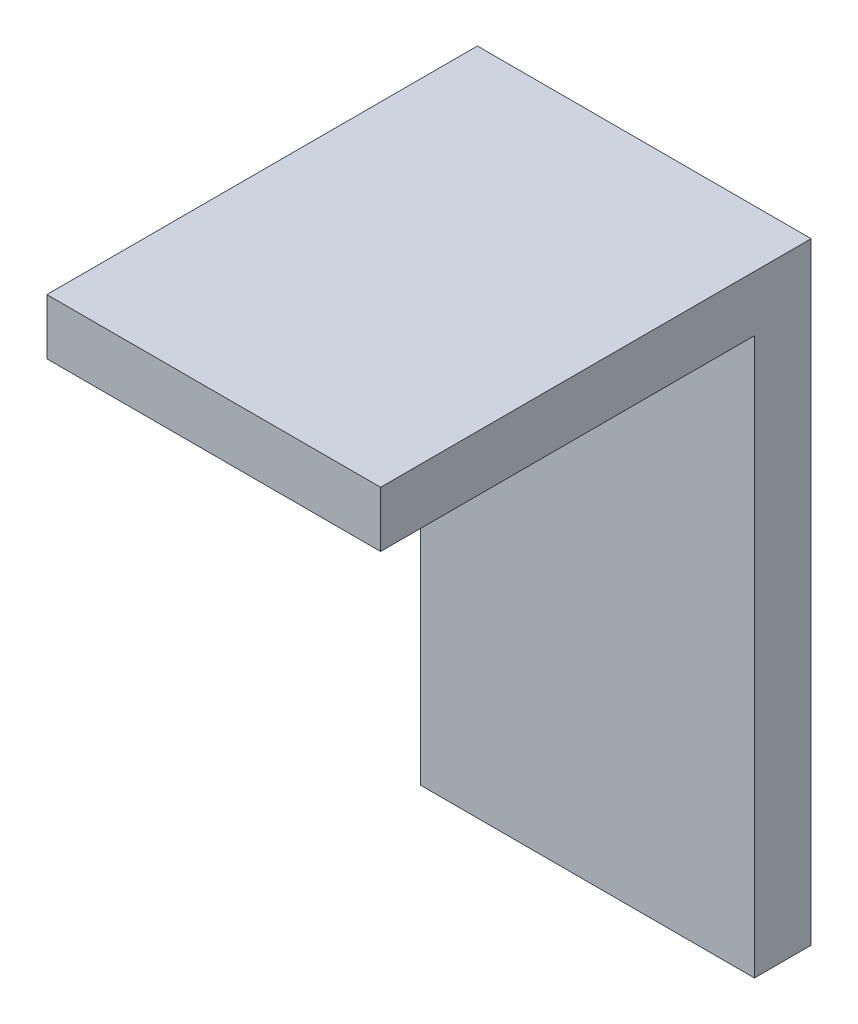
ISO-10303-21;
HEADER;
FILE_DESCRIPTION(('STEP AP214'),'2;1');
FILE_NAME('part.step','',(''),(''),'','','');
FILE_SCHEMA(('AUTOMOTIVE_DESIGN { 1 0 10303 214 1 1 1 1 }'));
ENDSEC;
DATA;
#1=APPLICATION_CONTEXT('core data for automotive mechanical design processes');
#2=APPLICATION_PROTOCOL_DEFINITION('international standard','automotive_design',2000,#1);
#3=PRODUCT_CONTEXT('',#1,'mechanical');
#4=PRODUCT('Part','Part','',(#3));
#5=PRODUCT_RELATED_PRODUCT_CATEGORY('part','',(#4));
#6=PRODUCT_DEFINITION_FORMATION('','',#4);
#7=PRODUCT_DEFINITION_CONTEXT('part definition',#1,'design');
#8=PRODUCT_DEFINITION('design','',#6,#7);
#9=PRODUCT_DEFINITION_SHAPE('','',#8);
#10=(LENGTH_UNIT() NAMED_UNIT(*) SI_UNIT(.MILLI.,.METRE.));
#11=(NAMED_UNIT(*) PLANE_ANGLE_UNIT() SI_UNIT($,.RADIAN.));
#12=(NAMED_UNIT(*) SI_UNIT($,.STERADIAN.) SOLID_ANGLE_UNIT());
#13=UNCERTAINTY_MEASURE_WITH_UNIT(LENGTH_MEASURE(1.E-05),#10,'distance_accuracy_value','');
#14=(GEOMETRIC_REPRESENTATION_CONTEXT(3) GLOBAL_UNCERTAINTY_ASSIGNED_CONTEXT((#13)) GLOBAL_UNIT_ASSIGNED_CONTEXT((#10,
#11,#12)) REPRESENTATION_CONTEXT('',''));
#15=CARTESIAN_POINT('',(0.,0.,0.));
#16=DIRECTION('',(0.,0.,1.));
#17=DIRECTION('',(1.,0.,0.));
#18=AXIS2_PLACEMENT_3D('',#15,#16,#17);
#19=CARTESIAN_POINT('',(2.6,4.55,0.));
#20=DIRECTION('',(-1.,0.,0.));
#21=DIRECTION('',(0.,0.,1.));
#22=AXIS2_PLACEMENT_3D('',#19,#20,#21);
#23=PLANE('',#22);
#24=DIRECTION('',(0.,1.,0.));
#25=VECTOR('',#24,1.);
#26=CARTESIAN_POINT('',(2.6,4.,0.));
#27=LINE('',#26,#25);
#28=CARTESIAN_POINT('',(2.6,4.,0.));
#29=VERTEX_POINT('',#28);
#30=CARTESIAN_POINT('',(2.6,4.55,0.));
#31=VERTEX_POINT('',#30);
#32=EDGE_CURVE('E11',#29,#31,#27,.T.);
#33=ORIENTED_EDGE('',*,*,#32,.F.);
#34=DIRECTION('',(0.,0.,-1.));
#35=VECTOR('',#34,1.);
#36=CARTESIAN_POINT('',(2.6,4.,0.051));
#37=LINE('',#36,#35);
#38=CARTESIAN_POINT('',(2.6,4.,0.051));
#39=VERTEX_POINT('',#38);
#40=EDGE_CURVE('E24',#39,#29,#37,.T.);
#41=ORIENTED_EDGE('',*,*,#40,.F.);
#42=DIRECTION('',(0.,-1.,0.));
#43=VECTOR('',#42,1.);
#44=CARTESIAN_POINT('',(2.6,4.5,0.051));
#45=LINE('',#44,#43);
#46=CARTESIAN_POINT('',(2.6,4.5,0.051));
#47=VERTEX_POINT('',#46);
#48=EDGE_CURVE('E87',#47,#39,#45,.T.);
#49=ORIENTED_EDGE('',*,*,#48,.F.);
#50=DIRECTION('',(0.,0.,-1.));
#51=VECTOR('',#50,1.);
#52=CARTESIAN_POINT('',(2.6,4.5,0.387));
#53=LINE('',#52,#51);
#54=CARTESIAN_POINT('',(2.6,4.5,0.387));
#55=VERTEX_POINT('',#54);
#56=EDGE_CURVE('E114',#55,#47,#53,.T.);
#57=ORIENTED_EDGE('',*,*,#56,.F.);
#58=DIRECTION('',(0.,-1.,0.));
#59=VECTOR('',#58,1.);
#60=CARTESIAN_POINT('',(2.6,4.55,0.387));
#61=LINE('',#60,#59);
#62=CARTESIAN_POINT('',(2.6,4.55,0.387));
#63=VERTEX_POINT('',#62);
#64=EDGE_CURVE('E111',#63,#55,#61,.T.);
#65=ORIENTED_EDGE('',*,*,#64,.F.);
#66=DIRECTION('',(0.,0.,1.));
#67=VECTOR('',#66,1.);
#68=CARTESIAN_POINT('',(2.6,4.55,0.));
#69=LINE('',#68,#67);
#70=EDGE_CURVE('E108',#31,#63,#69,.T.);
#71=ORIENTED_EDGE('',*,*,#70,.F.);
#72=EDGE_LOOP('',(#33,#41,#49,#57,#65,#71));
#73=FACE_BOUND('',#72,.T.);
#74=ADVANCED_FACE('F17',(#73),#23,.T.);
#75=CARTESIAN_POINT('',(2.9,4.,0.));
#76=DIRECTION('',(1.,0.,0.));
#77=DIRECTION('',(0.,0.,1.));
#78=AXIS2_PLACEMENT_3D('',#75,#76,#77);
#79=PLANE('',#78);
#80=DIRECTION('',(0.,-1.,0.));
#81=VECTOR('',#80,1.);
#82=CARTESIAN_POINT('',(2.9,4.55,0.));
#83=LINE('',#82,#81);
#84=CARTESIAN_POINT('',(2.9,4.55,0.));
#85=VERTEX_POINT('',#84);
#86=CARTESIAN_POINT('',(2.9,4.,0.));
#87=VERTEX_POINT('',#86);
#88=EDGE_CURVE('E106',#85,#87,#83,.T.);
#89=ORIENTED_EDGE('',*,*,#88,.F.);
#90=DIRECTION('',(0.,0.,-1.));
#91=VECTOR('',#90,1.);
#92=CARTESIAN_POINT('',(2.9,4.55,0.387));
#93=LINE('',#92,#91);
#94=CARTESIAN_POINT('',(2.9,4.55,0.387));
#95=VERTEX_POINT('',#94);
#96=EDGE_CURVE('E103',#95,#85,#93,.T.);
#97=ORIENTED_EDGE('',*,*,#96,.F.);
#98=DIRECTION('',(0.,1.,0.));
#99=VECTOR('',#98,1.);
#100=CARTESIAN_POINT('',(2.9,4.5,0.387));
#101=LINE('',#100,#99);
#102=CARTESIAN_POINT('',(2.9,4.5,0.387));
#103=VERTEX_POINT('',#102);
#104=EDGE_CURVE('E100',#103,#95,#101,.T.);
#105=ORIENTED_EDGE('',*,*,#104,.F.);
#106=DIRECTION('',(0.,0.,1.));
#107=VECTOR('',#106,1.);
#108=CARTESIAN_POINT('',(2.9,4.5,0.051));
#109=LINE('',#108,#107);
#110=CARTESIAN_POINT('',(2.9,4.5,0.051));
#111=VERTEX_POINT('',#110);
#112=EDGE_CURVE('E72',#111,#103,#109,.T.);
#113=ORIENTED_EDGE('',*,*,#112,.F.);
#114=DIRECTION('',(0.,1.,0.));
#115=VECTOR('',#114,1.);
#116=CARTESIAN_POINT('',(2.9,4.,0.051));
#117=LINE('',#116,#115);
#118=CARTESIAN_POINT('',(2.9,4.,0.051));
#119=VERTEX_POINT('',#118);
#120=EDGE_CURVE('E66',#119,#111,#117,.T.);
#121=ORIENTED_EDGE('',*,*,#120,.F.);
#122=DIRECTION('',(0.,0.,1.));
#123=VECTOR('',#122,1.);
#124=CARTESIAN_POINT('',(2.9,4.,0.));
#125=LINE('',#124,#123);
#126=EDGE_CURVE('E69',#87,#119,#125,.T.);
#127=ORIENTED_EDGE('',*,*,#126,.F.);
#128=EDGE_LOOP('',(#89,#97,#105,#113,#121,#127));
#129=FACE_BOUND('',#128,.T.);
#130=ADVANCED_FACE('F68',(#129),#79,.T.);
#131=CARTESIAN_POINT('',(2.6,4.55,0.387));
#132=DIRECTION('',(0.,0.,1.));
#133=DIRECTION('',(0.,1.,0.));
#134=AXIS2_PLACEMENT_3D('',#131,#132,#133);
#135=PLANE('',#134);
#136=ORIENTED_EDGE('',*,*,#64,.T.);
#137=DIRECTION('',(-1.,0.,0.));
#138=VECTOR('',#137,1.);
#139=CARTESIAN_POINT('',(2.9,4.5,0.387));
#140=LINE('',#139,#138);
#141=EDGE_CURVE('E83',#103,#55,#140,.T.);
#142=ORIENTED_EDGE('',*,*,#141,.F.);
#143=ORIENTED_EDGE('',*,*,#104,.T.);
#144=DIRECTION('',(1.,0.,0.));
#145=VECTOR('',#144,1.);
#146=CARTESIAN_POINT('',(2.6,4.55,0.387));
#147=LINE('',#146,#145);
#148=EDGE_CURVE('E88',#63,#95,#147,.T.);
#149=ORIENTED_EDGE('',*,*,#148,.F.);
#150=EDGE_LOOP('',(#136,#142,#143,#149));
#151=FACE_BOUND('',#150,.T.);
#152=ADVANCED_FACE('F125',(#151),#135,.T.);
#153=CARTESIAN_POINT('',(2.6,4.5,0.051));
#154=DIRECTION('',(0.,0.,1.));
#155=DIRECTION('',(0.,1.,0.));
#156=AXIS2_PLACEMENT_3D('',#153,#154,#155);
#157=PLANE('',#156);
#158=ORIENTED_EDGE('',*,*,#48,.T.);
#159=DIRECTION('',(-1.,0.,0.));
#160=VECTOR('',#159,1.);
#161=CARTESIAN_POINT('',(2.9,4.,0.051));
#162=LINE('',#161,#160);
#163=EDGE_CURVE('E81',#119,#39,#162,.T.);
#164=ORIENTED_EDGE('',*,*,#163,.F.);
#165=ORIENTED_EDGE('',*,*,#120,.T.);
#166=DIRECTION('',(1.,0.,0.));
#167=VECTOR('',#166,1.);
#168=CARTESIAN_POINT('',(2.6,4.5,0.051));
#169=LINE('',#168,#167);
#170=EDGE_CURVE('E89',#47,#111,#169,.T.);
#171=ORIENTED_EDGE('',*,*,#170,.F.);
#172=EDGE_LOOP('',(#158,#164,#165,#171));
#173=FACE_BOUND('',#172,.T.);
#174=ADVANCED_FACE('F86',(#173),#157,.T.);
#175=CARTESIAN_POINT('',(2.9,4.55,0.));
#176=DIRECTION('',(0.,1.,0.));
#177=DIRECTION('',(0.,0.,1.));
#178=AXIS2_PLACEMENT_3D('',#175,#176,#177);
#179=PLANE('',#178);
#180=DIRECTION('',(1.,0.,0.));
#181=VECTOR('',#180,1.);
#182=CARTESIAN_POINT('',(2.6,4.55,0.));
#183=LINE('',#182,#181);
#184=EDGE_CURVE('E93',#31,#85,#183,.T.);
#185=ORIENTED_EDGE('',*,*,#184,.F.);
#186=ORIENTED_EDGE('',*,*,#70,.T.);
#187=ORIENTED_EDGE('',*,*,#148,.T.);
#188=ORIENTED_EDGE('',*,*,#96,.T.);
#189=EDGE_LOOP('',(#185,#186,#187,#188));
#190=FACE_BOUND('',#189,.T.);
#191=ADVANCED_FACE('F121',(#190),#179,.T.);
#192=CARTESIAN_POINT('',(2.6,4.,0.));
#193=DIRECTION('',(0.,-1.,0.));
#194=DIRECTION('',(0.,0.,1.));
#195=AXIS2_PLACEMENT_3D('',#192,#193,#194);
#196=PLANE('',#195);
#197=DIRECTION('',(-1.,0.,0.));
#198=VECTOR('',#197,1.);
#199=CARTESIAN_POINT('',(2.9,4.,0.));
#200=LINE('',#199,#198);
#201=EDGE_CURVE('E82',#87,#29,#200,.T.);
#202=ORIENTED_EDGE('',*,*,#201,.F.);
#203=ORIENTED_EDGE('',*,*,#126,.T.);
#204=ORIENTED_EDGE('',*,*,#163,.T.);
#205=ORIENTED_EDGE('',*,*,#40,.T.);
#206=EDGE_LOOP('',(#202,#203,#204,#205));
#207=FACE_BOUND('',#206,.T.);
#208=ADVANCED_FACE('F80',(#207),#196,.T.);
#209=CARTESIAN_POINT('',(2.6,4.5,0.051));
#210=DIRECTION('',(0.,-1.,0.));
#211=DIRECTION('',(0.,0.,1.));
#212=AXIS2_PLACEMENT_3D('',#209,#210,#211);
#213=PLANE('',#212);
#214=ORIENTED_EDGE('',*,*,#170,.T.);
#215=ORIENTED_EDGE('',*,*,#112,.T.);
#216=ORIENTED_EDGE('',*,*,#141,.T.);
#217=ORIENTED_EDGE('',*,*,#56,.T.);
#218=EDGE_LOOP('',(#214,#215,#216,#217));
#219=FACE_BOUND('',#218,.T.);
#220=ADVANCED_FACE('F127',(#219),#213,.T.);
#221=CARTESIAN_POINT('',(2.9,4.55,0.));
#222=DIRECTION('',(0.,0.,-1.));
#223=DIRECTION('',(0.,1.,0.));
#224=AXIS2_PLACEMENT_3D('',#221,#222,#223);
#225=PLANE('',#224);
#226=ORIENTED_EDGE('',*,*,#88,.T.);
#227=ORIENTED_EDGE('',*,*,#201,.T.);
#228=ORIENTED_EDGE('',*,*,#32,.T.);
#229=ORIENTED_EDGE('',*,*,#184,.T.);
#230=EDGE_LOOP('',(#226,#227,#228,#229));
#231=FACE_BOUND('',#230,.T.);
#232=ADVANCED_FACE('F117',(#231),#225,.T.);
#233=CLOSED_SHELL('',(#74,#130,#152,#174,#191,#208,#220,#232));
#234=MANIFOLD_SOLID_BREP('B1',#233);
#235=ADVANCED_BREP_SHAPE_REPRESENTATION('',(#18,#234),#14);
#236=SHAPE_DEFINITION_REPRESENTATION(#9,#235);
ENDSEC;
END-ISO-10303-21;
